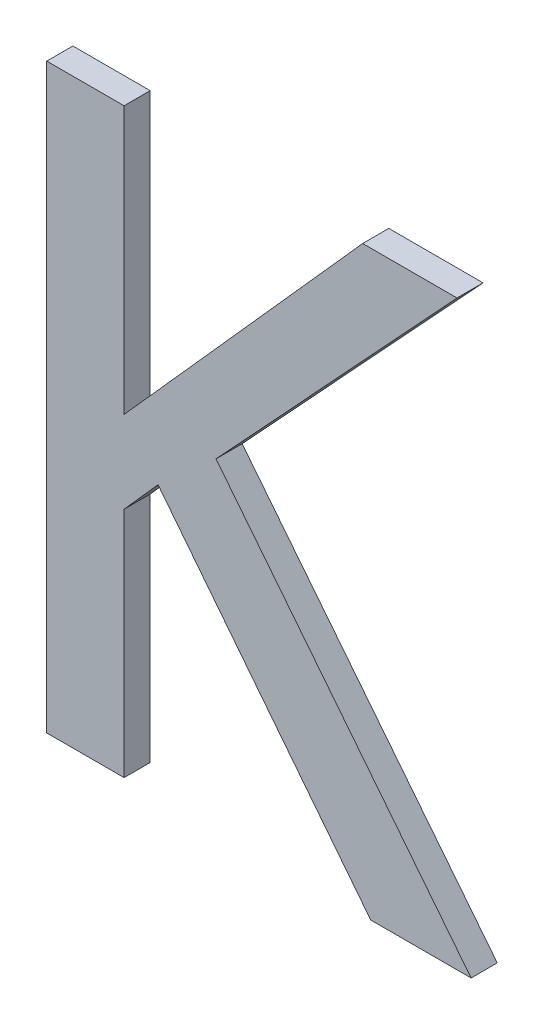
ISO-10303-21;
HEADER;
FILE_DESCRIPTION(('STEP AP214'),'2;1');
FILE_NAME('part.step','',(''),(''),'','','');
FILE_SCHEMA(('AUTOMOTIVE_DESIGN { 1 0 10303 214 1 1 1 1 }'));
ENDSEC;
DATA;
#1=APPLICATION_CONTEXT('core data for automotive mechanical design processes');
#2=APPLICATION_PROTOCOL_DEFINITION('international standard','automotive_design',2000,#1);
#3=PRODUCT_CONTEXT('',#1,'mechanical');
#4=PRODUCT('Part','Part','',(#3));
#5=PRODUCT_RELATED_PRODUCT_CATEGORY('part','',(#4));
#6=PRODUCT_DEFINITION_FORMATION('','',#4);
#7=PRODUCT_DEFINITION_CONTEXT('part definition',#1,'design');
#8=PRODUCT_DEFINITION('design','',#6,#7);
#9=PRODUCT_DEFINITION_SHAPE('','',#8);
#10=(LENGTH_UNIT() NAMED_UNIT(*) SI_UNIT(.MILLI.,.METRE.));
#11=(NAMED_UNIT(*) PLANE_ANGLE_UNIT() SI_UNIT($,.RADIAN.));
#12=(NAMED_UNIT(*) SI_UNIT($,.STERADIAN.) SOLID_ANGLE_UNIT());
#13=UNCERTAINTY_MEASURE_WITH_UNIT(LENGTH_MEASURE(1.E-05),#10,'distance_accuracy_value','');
#14=(GEOMETRIC_REPRESENTATION_CONTEXT(3) GLOBAL_UNCERTAINTY_ASSIGNED_CONTEXT((#13)) GLOBAL_UNIT_ASSIGNED_CONTEXT((#10,
#11,#12)) REPRESENTATION_CONTEXT('',''));
#15=CARTESIAN_POINT('',(0.,0.,0.));
#16=DIRECTION('',(0.,0.,1.));
#17=DIRECTION('',(1.,0.,0.));
#18=AXIS2_PLACEMENT_3D('',#15,#16,#17);
#19=CARTESIAN_POINT('',(-1.1041147439198,-1.3330119310953,0.00415));
#20=DIRECTION('',(0.,0.,1.));
#21=DIRECTION('',(1.,0.,0.));
#22=AXIS2_PLACEMENT_3D('',#19,#20,#21);
#23=PLANE('',#22);
#24=DIRECTION('',(1.,0.,0.));
#25=VECTOR('',#24,1.);
#26=CARTESIAN_POINT('',(-1.0842312122429,-1.3699380889616,0.00415));
#27=LINE('',#26,#25);
#28=CARTESIAN_POINT('',(-1.0842312122429,-1.3699380889616,0.00415));
#29=VERTEX_POINT('',#28);
#30=CARTESIAN_POINT('',(-1.0715444216509,-1.3699380889616,0.00415));
#31=VERTEX_POINT('',#30);
#32=EDGE_CURVE('E11',#29,#31,#27,.T.);
#33=ORIENTED_EDGE('',*,*,#32,.T.);
#34=DIRECTION('',(-0.620908701570169,0.783882889412983,0.));
#35=VECTOR('',#34,1.);
#36=CARTESIAN_POINT('',(-1.0715444216509,-1.3699380889616,0.00415));
#37=LINE('',#36,#35);
#38=CARTESIAN_POINT('',(-1.1037676785067,-1.3292569717111,0.00415));
#39=VERTEX_POINT('',#38);
#40=EDGE_CURVE('E24',#31,#39,#37,.T.);
#41=ORIENTED_EDGE('',*,*,#40,.T.);
#42=DIRECTION('',(0.679991598104563,0.733219903239951,0.));
#43=VECTOR('',#42,1.);
#44=CARTESIAN_POINT('',(-1.1037676785067,-1.3292569717111,0.00415));
#45=LINE('',#44,#43);
#46=CARTESIAN_POINT('',(-1.0733312935652,-1.2964380908838,0.00415));
#47=VERTEX_POINT('',#46);
#48=EDGE_CURVE('E188',#39,#47,#45,.T.);
#49=ORIENTED_EDGE('',*,*,#48,.T.);
#50=DIRECTION('',(-1.,0.,0.));
#51=VECTOR('',#50,1.);
#52=CARTESIAN_POINT('',(-1.0733312935652,-1.2964380908838,0.00415));
#53=LINE('',#52,#51);
#54=CARTESIAN_POINT('',(-1.0852437729944,-1.2964380908838,0.00415));
#55=VERTEX_POINT('',#54);
#56=EDGE_CURVE('E186',#47,#55,#53,.T.);
#57=ORIENTED_EDGE('',*,*,#56,.T.);
#58=DIRECTION('',(-0.665832703491977,-0.746101072885279,0.));
#59=VECTOR('',#58,1.);
#60=CARTESIAN_POINT('',(-1.0852437729944,-1.2964380908838,0.00415));
#61=LINE('',#60,#59);
#62=CARTESIAN_POINT('',(-1.1153823459501,-1.3302099700654,0.00415));
#63=VERTEX_POINT('',#62);
#64=EDGE_CURVE('E184',#55,#63,#61,.T.);
#65=ORIENTED_EDGE('',*,*,#64,.T.);
#66=DIRECTION('',(0.,1.,0.));
#67=VECTOR('',#66,1.);
#68=CARTESIAN_POINT('',(-1.1153823459501,-1.3302099700654,0.00415));
#69=LINE('',#68,#67);
#70=CARTESIAN_POINT('',(-1.1153823459501,-1.2964380908838,0.00415));
#71=VERTEX_POINT('',#70);
#72=EDGE_CURVE('E182',#63,#71,#69,.T.);
#73=ORIENTED_EDGE('',*,*,#72,.T.);
#74=DIRECTION('',(-1.,0.,0.));
#75=VECTOR('',#74,1.);
#76=CARTESIAN_POINT('',(-1.1153823459501,-1.2964380908838,0.00415));
#77=LINE('',#76,#75);
#78=CARTESIAN_POINT('',(-1.125150579082,-1.2964380908838,0.00415));
#79=VERTEX_POINT('',#78);
#80=EDGE_CURVE('E180',#71,#79,#77,.T.);
#81=ORIENTED_EDGE('',*,*,#80,.T.);
#82=DIRECTION('',(0.,-1.,0.));
#83=VECTOR('',#82,1.);
#84=CARTESIAN_POINT('',(-1.125150579082,-1.2964380908838,0.00415));
#85=LINE('',#84,#83);
#86=CARTESIAN_POINT('',(-1.125150579082,-1.3699380889616,0.00415));
#87=VERTEX_POINT('',#86);
#88=EDGE_CURVE('E178',#79,#87,#85,.T.);
#89=ORIENTED_EDGE('',*,*,#88,.T.);
#90=DIRECTION('',(1.,0.,0.));
#91=VECTOR('',#90,1.);
#92=CARTESIAN_POINT('',(-1.125150579082,-1.3699380889616,0.00415));
#93=LINE('',#92,#91);
#94=CARTESIAN_POINT('',(-1.1153823459501,-1.3699380889616,0.00415));
#95=VERTEX_POINT('',#94);
#96=EDGE_CURVE('E176',#87,#95,#93,.T.);
#97=ORIENTED_EDGE('',*,*,#96,.T.);
#98=DIRECTION('',(0.,1.,0.));
#99=VECTOR('',#98,1.);
#100=CARTESIAN_POINT('',(-1.1153823459501,-1.3699380889616,0.00415));
#101=LINE('',#100,#99);
#102=CARTESIAN_POINT('',(-1.1153823459501,-1.3405738271687,0.00415));
#103=VERTEX_POINT('',#102);
#104=EDGE_CURVE('E174',#95,#103,#101,.T.);
#105=ORIENTED_EDGE('',*,*,#104,.T.);
#106=DIRECTION('',(0.664363838829912,0.747409318683667,0.));
#107=VECTOR('',#106,1.);
#108=CARTESIAN_POINT('',(-1.1153823459501,-1.3405738271687,0.00415));
#109=LINE('',#108,#107);
#110=CARTESIAN_POINT('',(-1.1110938533556,-1.3357492729999,0.00415));
#111=VERTEX_POINT('',#110);
#112=EDGE_CURVE('E172',#103,#111,#109,.T.);
#113=ORIENTED_EDGE('',*,*,#112,.T.);
#114=DIRECTION('',(0.617821551931904,-0.786318338822422,0.));
#115=VECTOR('',#114,1.);
#116=CARTESIAN_POINT('',(-1.1110938533556,-1.3357492729999,0.00415));
#117=LINE('',#116,#115);
#118=EDGE_CURVE('E170',#111,#29,#117,.T.);
#119=ORIENTED_EDGE('',*,*,#118,.T.);
#120=EDGE_LOOP('',(#33,#41,#49,#57,#65,#73,#81,#89,#97,#105,#113,#119));
#121=FACE_BOUND('',#120,.T.);
#122=ADVANCED_FACE('F17',(#121),#23,.T.);
#123=CARTESIAN_POINT('',(-1.1110938533556,-1.3357492729999,0.00085));
#124=DIRECTION('',(-0.786318338822423,-0.617821551931904,0.));
#125=DIRECTION('',(0.617821551931904,-0.786318338822423,0.));
#126=AXIS2_PLACEMENT_3D('',#123,#124,#125);
#127=PLANE('',#126);
#128=DIRECTION('',(-0.617821551931904,0.786318338822423,0.));
#129=VECTOR('',#128,1.);
#130=CARTESIAN_POINT('',(-1.0842312122429,-1.3699380889616,0.00085));
#131=LINE('',#130,#129);
#132=CARTESIAN_POINT('',(-1.0842312122429,-1.3699380889616,0.00085));
#133=VERTEX_POINT('',#132);
#134=CARTESIAN_POINT('',(-1.1110938533556,-1.3357492729999,0.00085));
#135=VERTEX_POINT('',#134);
#136=EDGE_CURVE('E168',#133,#135,#131,.T.);
#137=ORIENTED_EDGE('',*,*,#136,.F.);
#138=DIRECTION('',(0.,0.,1.));
#139=VECTOR('',#138,1.);
#140=CARTESIAN_POINT('',(-1.0842312122429,-1.3699380889616,0.00085));
#141=LINE('',#140,#139);
#142=EDGE_CURVE('E119',#133,#29,#141,.T.);
#143=ORIENTED_EDGE('',*,*,#142,.T.);
#144=ORIENTED_EDGE('',*,*,#118,.F.);
#145=DIRECTION('',(0.,0.,1.));
#146=VECTOR('',#145,1.);
#147=CARTESIAN_POINT('',(-1.1110938533556,-1.3357492729999,0.00085));
#148=LINE('',#147,#146);
#149=EDGE_CURVE('E164',#135,#111,#148,.T.);
#150=ORIENTED_EDGE('',*,*,#149,.F.);
#151=EDGE_LOOP('',(#137,#143,#144,#150));
#152=FACE_BOUND('',#151,.T.);
#153=ADVANCED_FACE('F235',(#152),#127,.T.);
#154=CARTESIAN_POINT('',(-1.1153823459501,-1.3405738271687,0.00085));
#155=DIRECTION('',(0.747409318683659,-0.664363838829921,0.));
#156=DIRECTION('',(0.664363838829921,0.747409318683659,0.));
#157=AXIS2_PLACEMENT_3D('',#154,#155,#156);
#158=PLANE('',#157);
#159=DIRECTION('',(-0.664363838829921,-0.747409318683659,0.));
#160=VECTOR('',#159,1.);
#161=CARTESIAN_POINT('',(-1.1110938533556,-1.3357492729999,0.00085));
#162=LINE('',#161,#160);
#163=CARTESIAN_POINT('',(-1.1153823459501,-1.3405738271687,0.00085));
#164=VERTEX_POINT('',#163);
#165=EDGE_CURVE('E162',#135,#164,#162,.T.);
#166=ORIENTED_EDGE('',*,*,#165,.F.);
#167=ORIENTED_EDGE('',*,*,#149,.T.);
#168=ORIENTED_EDGE('',*,*,#112,.F.);
#169=DIRECTION('',(0.,0.,1.));
#170=VECTOR('',#169,1.);
#171=CARTESIAN_POINT('',(-1.1153823459501,-1.3405738271687,0.00085));
#172=LINE('',#171,#170);
#173=EDGE_CURVE('E159',#164,#103,#172,.T.);
#174=ORIENTED_EDGE('',*,*,#173,.F.);
#175=EDGE_LOOP('',(#166,#167,#168,#174));
#176=FACE_BOUND('',#175,.T.);
#177=ADVANCED_FACE('F232',(#176),#158,.T.);
#178=CARTESIAN_POINT('',(-1.1153823459501,-1.3699380889616,0.00085));
#179=DIRECTION('',(1.,0.,0.));
#180=DIRECTION('',(0.,1.,0.));
#181=AXIS2_PLACEMENT_3D('',#178,#179,#180);
#182=PLANE('',#181);
#183=DIRECTION('',(0.,-1.,0.));
#184=VECTOR('',#183,1.);
#185=CARTESIAN_POINT('',(-1.1153823459501,-1.3405738271687,0.00085));
#186=LINE('',#185,#184);
#187=CARTESIAN_POINT('',(-1.1153823459501,-1.3699380889616,0.00085));
#188=VERTEX_POINT('',#187);
#189=EDGE_CURVE('E157',#164,#188,#186,.T.);
#190=ORIENTED_EDGE('',*,*,#189,.F.);
#191=ORIENTED_EDGE('',*,*,#173,.T.);
#192=ORIENTED_EDGE('',*,*,#104,.F.);
#193=DIRECTION('',(0.,0.,1.));
#194=VECTOR('',#193,1.);
#195=CARTESIAN_POINT('',(-1.1153823459501,-1.3699380889616,0.00085));
#196=LINE('',#195,#194);
#197=EDGE_CURVE('E154',#188,#95,#196,.T.);
#198=ORIENTED_EDGE('',*,*,#197,.F.);
#199=EDGE_LOOP('',(#190,#191,#192,#198));
#200=FACE_BOUND('',#199,.T.);
#201=ADVANCED_FACE('F226',(#200),#182,.T.);
#202=CARTESIAN_POINT('',(-1.125150579082,-1.3699380889616,0.00085));
#203=DIRECTION('',(0.,-1.,0.));
#204=DIRECTION('',(1.,0.,0.));
#205=AXIS2_PLACEMENT_3D('',#202,#203,#204);
#206=PLANE('',#205);
#207=DIRECTION('',(-1.,0.,0.));
#208=VECTOR('',#207,1.);
#209=CARTESIAN_POINT('',(-1.1153823459501,-1.3699380889616,0.00085));
#210=LINE('',#209,#208);
#211=CARTESIAN_POINT('',(-1.125150579082,-1.3699380889616,0.00085));
#212=VERTEX_POINT('',#211);
#213=EDGE_CURVE('E152',#188,#212,#210,.T.);
#214=ORIENTED_EDGE('',*,*,#213,.F.);
#215=ORIENTED_EDGE('',*,*,#197,.T.);
#216=ORIENTED_EDGE('',*,*,#96,.F.);
#217=DIRECTION('',(0.,0.,1.));
#218=VECTOR('',#217,1.);
#219=CARTESIAN_POINT('',(-1.125150579082,-1.3699380889616,0.00085));
#220=LINE('',#219,#218);
#221=EDGE_CURVE('E149',#212,#87,#220,.T.);
#222=ORIENTED_EDGE('',*,*,#221,.F.);
#223=EDGE_LOOP('',(#214,#215,#216,#222));
#224=FACE_BOUND('',#223,.T.);
#225=ADVANCED_FACE('F222',(#224),#206,.T.);
#226=CARTESIAN_POINT('',(-1.125150579082,-1.2964380908838,0.00085));
#227=DIRECTION('',(-1.,0.,0.));
#228=DIRECTION('',(0.,-1.,0.));
#229=AXIS2_PLACEMENT_3D('',#226,#227,#228);
#230=PLANE('',#229);
#231=DIRECTION('',(0.,1.,0.));
#232=VECTOR('',#231,1.);
#233=CARTESIAN_POINT('',(-1.125150579082,-1.3699380889616,0.00085));
#234=LINE('',#233,#232);
#235=CARTESIAN_POINT('',(-1.125150579082,-1.2964380908838,0.00085));
#236=VERTEX_POINT('',#235);
#237=EDGE_CURVE('E147',#212,#236,#234,.T.);
#238=ORIENTED_EDGE('',*,*,#237,.F.);
#239=ORIENTED_EDGE('',*,*,#221,.T.);
#240=ORIENTED_EDGE('',*,*,#88,.F.);
#241=DIRECTION('',(0.,0.,1.));
#242=VECTOR('',#241,1.);
#243=CARTESIAN_POINT('',(-1.125150579082,-1.2964380908838,0.00085));
#244=LINE('',#243,#242);
#245=EDGE_CURVE('E144',#236,#79,#244,.T.);
#246=ORIENTED_EDGE('',*,*,#245,.F.);
#247=EDGE_LOOP('',(#238,#239,#240,#246));
#248=FACE_BOUND('',#247,.T.);
#249=ADVANCED_FACE('F216',(#248),#230,.T.);
#250=CARTESIAN_POINT('',(-1.1153823459501,-1.2964380908838,0.00085));
#251=DIRECTION('',(0.,1.,0.));
#252=DIRECTION('',(-1.,0.,0.));
#253=AXIS2_PLACEMENT_3D('',#250,#251,#252);
#254=PLANE('',#253);
#255=DIRECTION('',(1.,0.,0.));
#256=VECTOR('',#255,1.);
#257=CARTESIAN_POINT('',(-1.125150579082,-1.2964380908838,0.00085));
#258=LINE('',#257,#256);
#259=CARTESIAN_POINT('',(-1.1153823459501,-1.2964380908838,0.00085));
#260=VERTEX_POINT('',#259);
#261=EDGE_CURVE('E142',#236,#260,#258,.T.);
#262=ORIENTED_EDGE('',*,*,#261,.F.);
#263=ORIENTED_EDGE('',*,*,#245,.T.);
#264=ORIENTED_EDGE('',*,*,#80,.F.);
#265=DIRECTION('',(0.,0.,1.));
#266=VECTOR('',#265,1.);
#267=CARTESIAN_POINT('',(-1.1153823459501,-1.2964380908838,0.00085));
#268=LINE('',#267,#266);
#269=EDGE_CURVE('E139',#260,#71,#268,.T.);
#270=ORIENTED_EDGE('',*,*,#269,.F.);
#271=EDGE_LOOP('',(#262,#263,#264,#270));
#272=FACE_BOUND('',#271,.T.);
#273=ADVANCED_FACE('F212',(#272),#254,.T.);
#274=CARTESIAN_POINT('',(-1.1153823459501,-1.3302099700654,0.00085));
#275=DIRECTION('',(1.,0.,0.));
#276=DIRECTION('',(0.,1.,0.));
#277=AXIS2_PLACEMENT_3D('',#274,#275,#276);
#278=PLANE('',#277);
#279=DIRECTION('',(0.,-1.,0.));
#280=VECTOR('',#279,1.);
#281=CARTESIAN_POINT('',(-1.1153823459501,-1.2964380908838,0.00085));
#282=LINE('',#281,#280);
#283=CARTESIAN_POINT('',(-1.1153823459501,-1.3302099700654,0.00085));
#284=VERTEX_POINT('',#283);
#285=EDGE_CURVE('E137',#260,#284,#282,.T.);
#286=ORIENTED_EDGE('',*,*,#285,.F.);
#287=ORIENTED_EDGE('',*,*,#269,.T.);
#288=ORIENTED_EDGE('',*,*,#72,.F.);
#289=DIRECTION('',(0.,0.,1.));
#290=VECTOR('',#289,1.);
#291=CARTESIAN_POINT('',(-1.1153823459501,-1.3302099700654,0.00085));
#292=LINE('',#291,#290);
#293=EDGE_CURVE('E134',#284,#63,#292,.T.);
#294=ORIENTED_EDGE('',*,*,#293,.F.);
#295=EDGE_LOOP('',(#286,#287,#288,#294));
#296=FACE_BOUND('',#295,.T.);
#297=ADVANCED_FACE('F206',(#296),#278,.T.);
#298=CARTESIAN_POINT('',(-1.0852437729944,-1.2964380908838,0.00085));
#299=DIRECTION('',(-0.746101072885279,0.665832703491977,0.));
#300=DIRECTION('',(-0.665832703491977,-0.746101072885279,0.));
#301=AXIS2_PLACEMENT_3D('',#298,#299,#300);
#302=PLANE('',#301);
#303=DIRECTION('',(0.665832703491977,0.746101072885279,0.));
#304=VECTOR('',#303,1.);
#305=CARTESIAN_POINT('',(-1.1153823459501,-1.3302099700654,0.00085));
#306=LINE('',#305,#304);
#307=CARTESIAN_POINT('',(-1.0852437729944,-1.2964380908838,0.00085));
#308=VERTEX_POINT('',#307);
#309=EDGE_CURVE('E132',#284,#308,#306,.T.);
#310=ORIENTED_EDGE('',*,*,#309,.F.);
#311=ORIENTED_EDGE('',*,*,#293,.T.);
#312=ORIENTED_EDGE('',*,*,#64,.F.);
#313=DIRECTION('',(0.,0.,1.));
#314=VECTOR('',#313,1.);
#315=CARTESIAN_POINT('',(-1.0852437729944,-1.2964380908838,0.00085));
#316=LINE('',#315,#314);
#317=EDGE_CURVE('E129',#308,#55,#316,.T.);
#318=ORIENTED_EDGE('',*,*,#317,.F.);
#319=EDGE_LOOP('',(#310,#311,#312,#318));
#320=FACE_BOUND('',#319,.T.);
#321=ADVANCED_FACE('F202',(#320),#302,.T.);
#322=CARTESIAN_POINT('',(-1.0733312935652,-1.2964380908838,0.00085));
#323=DIRECTION('',(0.,1.,0.));
#324=DIRECTION('',(-1.,0.,0.));
#325=AXIS2_PLACEMENT_3D('',#322,#323,#324);
#326=PLANE('',#325);
#327=DIRECTION('',(1.,0.,0.));
#328=VECTOR('',#327,1.);
#329=CARTESIAN_POINT('',(-1.0852437729944,-1.2964380908838,0.00085));
#330=LINE('',#329,#328);
#331=CARTESIAN_POINT('',(-1.0733312935652,-1.2964380908838,0.00085));
#332=VERTEX_POINT('',#331);
#333=EDGE_CURVE('E127',#308,#332,#330,.T.);
#334=ORIENTED_EDGE('',*,*,#333,.F.);
#335=ORIENTED_EDGE('',*,*,#317,.T.);
#336=ORIENTED_EDGE('',*,*,#56,.F.);
#337=DIRECTION('',(0.,0.,1.));
#338=VECTOR('',#337,1.);
#339=CARTESIAN_POINT('',(-1.0733312935652,-1.2964380908838,0.00085));
#340=LINE('',#339,#338);
#341=EDGE_CURVE('E124',#332,#47,#340,.T.);
#342=ORIENTED_EDGE('',*,*,#341,.F.);
#343=EDGE_LOOP('',(#334,#335,#336,#342));
#344=FACE_BOUND('',#343,.T.);
#345=ADVANCED_FACE('F196',(#344),#326,.T.);
#346=CARTESIAN_POINT('',(-1.1037676785067,-1.3292569717111,0.00085));
#347=DIRECTION('',(0.73321990323995,-0.679991598104563,0.));
#348=DIRECTION('',(0.679991598104563,0.73321990323995,0.));
#349=AXIS2_PLACEMENT_3D('',#346,#347,#348);
#350=PLANE('',#349);
#351=DIRECTION('',(-0.679991598104563,-0.73321990323995,0.));
#352=VECTOR('',#351,1.);
#353=CARTESIAN_POINT('',(-1.0733312935652,-1.2964380908838,0.00085));
#354=LINE('',#353,#352);
#355=CARTESIAN_POINT('',(-1.1037676785067,-1.3292569717111,0.00085));
#356=VERTEX_POINT('',#355);
#357=EDGE_CURVE('E108',#332,#356,#354,.T.);
#358=ORIENTED_EDGE('',*,*,#357,.F.);
#359=ORIENTED_EDGE('',*,*,#341,.T.);
#360=ORIENTED_EDGE('',*,*,#48,.F.);
#361=DIRECTION('',(0.,0.,1.));
#362=VECTOR('',#361,1.);
#363=CARTESIAN_POINT('',(-1.1037676785067,-1.3292569717111,0.00085));
#364=LINE('',#363,#362);
#365=EDGE_CURVE('E112',#356,#39,#364,.T.);
#366=ORIENTED_EDGE('',*,*,#365,.F.);
#367=EDGE_LOOP('',(#358,#359,#360,#366));
#368=FACE_BOUND('',#367,.T.);
#369=ADVANCED_FACE('F192',(#368),#350,.T.);
#370=CARTESIAN_POINT('',(-1.0715444216509,-1.3699380889616,0.00085));
#371=DIRECTION('',(0.783882889412984,0.620908701570168,0.));
#372=DIRECTION('',(-0.620908701570168,0.783882889412984,0.));
#373=AXIS2_PLACEMENT_3D('',#370,#371,#372);
#374=PLANE('',#373);
#375=DIRECTION('',(0.620908701570168,-0.783882889412984,0.));
#376=VECTOR('',#375,1.);
#377=CARTESIAN_POINT('',(-1.1037676785067,-1.3292569717111,0.00085));
#378=LINE('',#377,#376);
#379=CARTESIAN_POINT('',(-1.0715444216509,-1.3699380889616,0.00085));
#380=VERTEX_POINT('',#379);
#381=EDGE_CURVE('E102',#356,#380,#378,.T.);
#382=ORIENTED_EDGE('',*,*,#381,.F.);
#383=ORIENTED_EDGE('',*,*,#365,.T.);
#384=ORIENTED_EDGE('',*,*,#40,.F.);
#385=DIRECTION('',(0.,0.,1.));
#386=VECTOR('',#385,1.);
#387=CARTESIAN_POINT('',(-1.0715444216509,-1.3699380889616,0.00085));
#388=LINE('',#387,#386);
#389=EDGE_CURVE('E113',#380,#31,#388,.T.);
#390=ORIENTED_EDGE('',*,*,#389,.F.);
#391=EDGE_LOOP('',(#382,#383,#384,#390));
#392=FACE_BOUND('',#391,.T.);
#393=ADVANCED_FACE('F115',(#392),#374,.T.);
#394=CARTESIAN_POINT('',(-1.0842312122429,-1.3699380889616,0.00085));
#395=DIRECTION('',(0.,-1.,0.));
#396=DIRECTION('',(1.,0.,0.));
#397=AXIS2_PLACEMENT_3D('',#394,#395,#396);
#398=PLANE('',#397);
#399=DIRECTION('',(-1.,0.,0.));
#400=VECTOR('',#399,1.);
#401=CARTESIAN_POINT('',(-1.0715444216509,-1.3699380889616,0.00085));
#402=LINE('',#401,#400);
#403=EDGE_CURVE('E106',#380,#133,#402,.T.);
#404=ORIENTED_EDGE('',*,*,#403,.F.);
#405=ORIENTED_EDGE('',*,*,#389,.T.);
#406=ORIENTED_EDGE('',*,*,#32,.F.);
#407=ORIENTED_EDGE('',*,*,#142,.F.);
#408=EDGE_LOOP('',(#404,#405,#406,#407));
#409=FACE_BOUND('',#408,.T.);
#410=ADVANCED_FACE('F117',(#409),#398,.T.);
#411=CARTESIAN_POINT('',(-1.1041147439198,-1.3330119310953,0.00085));
#412=DIRECTION('',(0.,0.,1.));
#413=DIRECTION('',(1.,0.,0.));
#414=AXIS2_PLACEMENT_3D('',#411,#412,#413);
#415=PLANE('',#414);
#416=ORIENTED_EDGE('',*,*,#403,.T.);
#417=ORIENTED_EDGE('',*,*,#136,.T.);
#418=ORIENTED_EDGE('',*,*,#165,.T.);
#419=ORIENTED_EDGE('',*,*,#189,.T.);
#420=ORIENTED_EDGE('',*,*,#213,.T.);
#421=ORIENTED_EDGE('',*,*,#237,.T.);
#422=ORIENTED_EDGE('',*,*,#261,.T.);
#423=ORIENTED_EDGE('',*,*,#285,.T.);
#424=ORIENTED_EDGE('',*,*,#309,.T.);
#425=ORIENTED_EDGE('',*,*,#333,.T.);
#426=ORIENTED_EDGE('',*,*,#357,.T.);
#427=ORIENTED_EDGE('',*,*,#381,.T.);
#428=EDGE_LOOP('',(#416,#417,#418,#419,#420,#421,#422,#423,#424,#425,#426,#427));
#429=FACE_BOUND('',#428,.T.);
#430=ADVANCED_FACE('F104',(#429),#415,.F.);
#431=CLOSED_SHELL('',(#122,#153,#177,#201,#225,#249,#273,#297,#321,#345,#369,#393,#410,#430));
#432=MANIFOLD_SOLID_BREP('B1',#431);
#433=ADVANCED_BREP_SHAPE_REPRESENTATION('',(#18,#432),#14);
#434=SHAPE_DEFINITION_REPRESENTATION(#9,#433);
ENDSEC;
END-ISO-10303-21;
